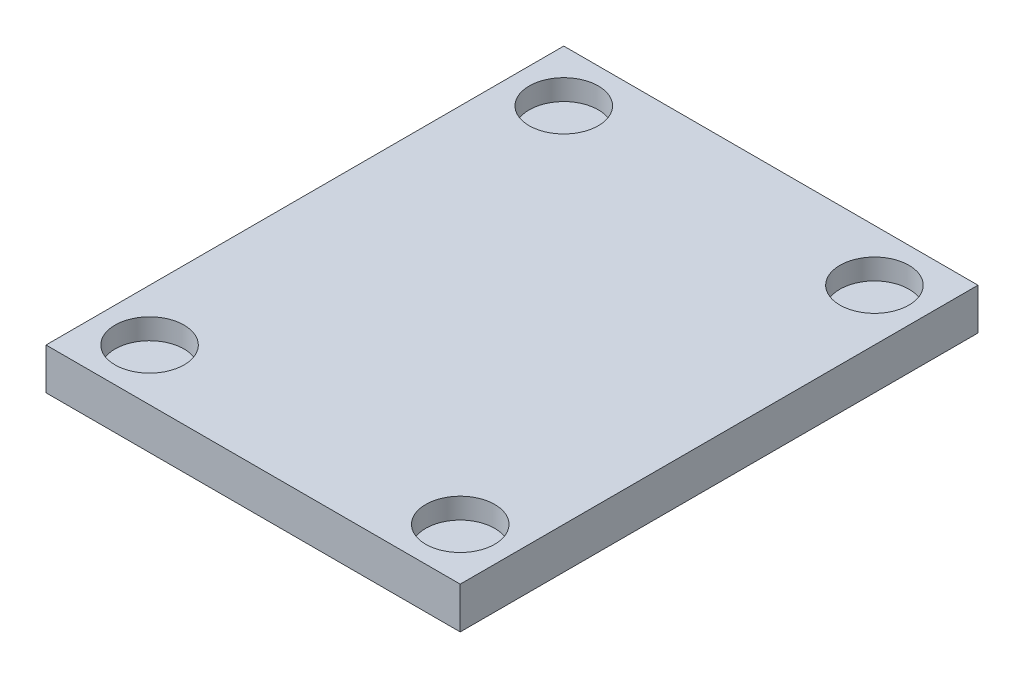
ISO-10303-21;
HEADER;
FILE_DESCRIPTION(('STEP AP214'),'2;1');
FILE_NAME('part.step','',(''),(''),'','','');
FILE_SCHEMA(('AUTOMOTIVE_DESIGN { 1 0 10303 214 1 1 1 1 }'));
ENDSEC;
DATA;
#1=APPLICATION_CONTEXT('core data for automotive mechanical design processes');
#2=APPLICATION_PROTOCOL_DEFINITION('international standard','automotive_design',2000,#1);
#3=PRODUCT_CONTEXT('',#1,'mechanical');
#4=PRODUCT('Part','Part','',(#3));
#5=PRODUCT_RELATED_PRODUCT_CATEGORY('part','',(#4));
#6=PRODUCT_DEFINITION_FORMATION('','',#4);
#7=PRODUCT_DEFINITION_CONTEXT('part definition',#1,'design');
#8=PRODUCT_DEFINITION('design','',#6,#7);
#9=PRODUCT_DEFINITION_SHAPE('','',#8);
#10=(LENGTH_UNIT() NAMED_UNIT(*) SI_UNIT(.MILLI.,.METRE.));
#11=(NAMED_UNIT(*) PLANE_ANGLE_UNIT() SI_UNIT($,.RADIAN.));
#12=(NAMED_UNIT(*) SI_UNIT($,.STERADIAN.) SOLID_ANGLE_UNIT());
#13=UNCERTAINTY_MEASURE_WITH_UNIT(LENGTH_MEASURE(1.E-05),#10,'distance_accuracy_value','');
#14=(GEOMETRIC_REPRESENTATION_CONTEXT(3) GLOBAL_UNCERTAINTY_ASSIGNED_CONTEXT((#13)) GLOBAL_UNIT_ASSIGNED_CONTEXT((#10,
#11,#12)) REPRESENTATION_CONTEXT('',''));
#15=CARTESIAN_POINT('',(0.,0.,0.));
#16=DIRECTION('',(0.,0.,1.));
#17=DIRECTION('',(1.,0.,0.));
#18=AXIS2_PLACEMENT_3D('',#15,#16,#17);
#19=CARTESIAN_POINT('',(30.,3.,75.));
#20=DIRECTION('',(-1.,0.,0.));
#21=DIRECTION('',(0.,0.,1.));
#22=AXIS2_PLACEMENT_3D('',#19,#20,#21);
#23=PLANE('',#22);
#24=DIRECTION('',(0.,1.,0.));
#25=VECTOR('',#24,1.);
#26=CARTESIAN_POINT('',(30.,3.,0.));
#27=LINE('',#26,#25);
#28=CARTESIAN_POINT('',(30.,-3.,0.));
#29=VERTEX_POINT('',#28);
#30=CARTESIAN_POINT('',(30.,3.,0.));
#31=VERTEX_POINT('',#30);
#32=EDGE_CURVE('E96',#29,#31,#27,.T.);
#33=ORIENTED_EDGE('',*,*,#32,.T.);
#34=DIRECTION('',(0.,0.,-1.));
#35=VECTOR('',#34,1.);
#36=CARTESIAN_POINT('',(30.,3.,75.));
#37=LINE('',#36,#35);
#38=CARTESIAN_POINT('',(30.,3.,75.));
#39=VERTEX_POINT('',#38);
#40=EDGE_CURVE('E11',#39,#31,#37,.T.);
#41=ORIENTED_EDGE('',*,*,#40,.F.);
#42=DIRECTION('',(0.,1.,0.));
#43=VECTOR('',#42,1.);
#44=CARTESIAN_POINT('',(30.,3.,75.));
#45=LINE('',#44,#43);
#46=CARTESIAN_POINT('',(30.,-3.,75.));
#47=VERTEX_POINT('',#46);
#48=EDGE_CURVE('E84',#47,#39,#45,.T.);
#49=ORIENTED_EDGE('',*,*,#48,.F.);
#50=DIRECTION('',(0.,0.,-1.));
#51=VECTOR('',#50,1.);
#52=CARTESIAN_POINT('',(30.,-3.,75.));
#53=LINE('',#52,#51);
#54=EDGE_CURVE('E92',#47,#29,#53,.T.);
#55=ORIENTED_EDGE('',*,*,#54,.T.);
#56=EDGE_LOOP('',(#33,#41,#49,#55));
#57=FACE_BOUND('',#56,.T.);
#58=ADVANCED_FACE('F33',(#57),#23,.F.);
#59=CARTESIAN_POINT('',(-30.,3.,75.));
#60=DIRECTION('',(0.,-1.,0.));
#61=DIRECTION('',(0.,0.,-1.));
#62=AXIS2_PLACEMENT_3D('',#59,#60,#61);
#63=PLANE('',#62);
#64=CARTESIAN_POINT('',(-22.5,3.,67.5));
#65=DIRECTION('',(0.,1.,0.));
#66=DIRECTION('',(0.,0.,1.));
#67=AXIS2_PLACEMENT_3D('',#64,#65,#66);
#68=CIRCLE('',#67,5.);
#69=CARTESIAN_POINT('',(-22.5,3.,72.5));
#70=VERTEX_POINT('',#69);
#71=EDGE_CURVE('E128',#70,#70,#68,.T.);
#72=ORIENTED_EDGE('',*,*,#71,.F.);
#73=EDGE_LOOP('',(#72));
#74=FACE_BOUND('',#73,.T.);
#75=CARTESIAN_POINT('',(-22.5,3.,7.5));
#76=DIRECTION('',(0.,1.,0.));
#77=DIRECTION('',(0.,0.,1.));
#78=AXIS2_PLACEMENT_3D('',#75,#76,#77);
#79=CIRCLE('',#78,5.);
#80=CARTESIAN_POINT('',(-22.5,3.,12.5));
#81=VERTEX_POINT('',#80);
#82=EDGE_CURVE('E122',#81,#81,#79,.T.);
#83=ORIENTED_EDGE('',*,*,#82,.F.);
#84=EDGE_LOOP('',(#83));
#85=FACE_BOUND('',#84,.T.);
#86=CARTESIAN_POINT('',(22.5,3.,7.5));
#87=DIRECTION('',(0.,1.,0.));
#88=DIRECTION('',(0.,0.,1.));
#89=AXIS2_PLACEMENT_3D('',#86,#87,#88);
#90=CIRCLE('',#89,5.);
#91=CARTESIAN_POINT('',(22.5,3.,12.5));
#92=VERTEX_POINT('',#91);
#93=EDGE_CURVE('E116',#92,#92,#90,.T.);
#94=ORIENTED_EDGE('',*,*,#93,.F.);
#95=EDGE_LOOP('',(#94));
#96=FACE_BOUND('',#95,.T.);
#97=CARTESIAN_POINT('',(22.5,3.,67.5));
#98=DIRECTION('',(0.,1.,0.));
#99=DIRECTION('',(0.,0.,1.));
#100=AXIS2_PLACEMENT_3D('',#97,#98,#99);
#101=CIRCLE('',#100,5.);
#102=CARTESIAN_POINT('',(22.5,3.,72.5));
#103=VERTEX_POINT('',#102);
#104=EDGE_CURVE('E110',#103,#103,#101,.T.);
#105=ORIENTED_EDGE('',*,*,#104,.F.);
#106=EDGE_LOOP('',(#105));
#107=FACE_BOUND('',#106,.T.);
#108=DIRECTION('',(-1.,0.,0.));
#109=VECTOR('',#108,1.);
#110=CARTESIAN_POINT('',(-30.,3.,0.));
#111=LINE('',#110,#109);
#112=CARTESIAN_POINT('',(-30.,3.,0.));
#113=VERTEX_POINT('',#112);
#114=EDGE_CURVE('E88',#31,#113,#111,.T.);
#115=ORIENTED_EDGE('',*,*,#114,.T.);
#116=DIRECTION('',(0.,0.,-1.));
#117=VECTOR('',#116,1.);
#118=CARTESIAN_POINT('',(-30.,3.,75.));
#119=LINE('',#118,#117);
#120=CARTESIAN_POINT('',(-30.,3.,75.));
#121=VERTEX_POINT('',#120);
#122=EDGE_CURVE('E41',#121,#113,#119,.T.);
#123=ORIENTED_EDGE('',*,*,#122,.F.);
#124=DIRECTION('',(-1.,0.,0.));
#125=VECTOR('',#124,1.);
#126=CARTESIAN_POINT('',(-30.,3.,75.));
#127=LINE('',#126,#125);
#128=EDGE_CURVE('E79',#39,#121,#127,.T.);
#129=ORIENTED_EDGE('',*,*,#128,.F.);
#130=ORIENTED_EDGE('',*,*,#40,.T.);
#131=EDGE_LOOP('',(#115,#123,#129,#130));
#132=FACE_BOUND('',#131,.T.);
#133=ADVANCED_FACE('F87',(#74,#85,#96,#107,#132),#63,.F.);
#134=CARTESIAN_POINT('',(-30.,3.,75.));
#135=DIRECTION('',(1.,0.,0.));
#136=DIRECTION('',(0.,0.,-1.));
#137=AXIS2_PLACEMENT_3D('',#134,#135,#136);
#138=PLANE('',#137);
#139=DIRECTION('',(0.,-1.,0.));
#140=VECTOR('',#139,1.);
#141=CARTESIAN_POINT('',(-30.,3.,0.));
#142=LINE('',#141,#140);
#143=CARTESIAN_POINT('',(-30.,-3.,0.));
#144=VERTEX_POINT('',#143);
#145=EDGE_CURVE('E66',#113,#144,#142,.T.);
#146=ORIENTED_EDGE('',*,*,#145,.T.);
#147=DIRECTION('',(0.,0.,-1.));
#148=VECTOR('',#147,1.);
#149=CARTESIAN_POINT('',(-30.,-3.,75.));
#150=LINE('',#149,#148);
#151=CARTESIAN_POINT('',(-30.,-3.,75.));
#152=VERTEX_POINT('',#151);
#153=EDGE_CURVE('E89',#152,#144,#150,.T.);
#154=ORIENTED_EDGE('',*,*,#153,.F.);
#155=DIRECTION('',(0.,-1.,0.));
#156=VECTOR('',#155,1.);
#157=CARTESIAN_POINT('',(-30.,3.,75.));
#158=LINE('',#157,#156);
#159=EDGE_CURVE('E82',#121,#152,#158,.T.);
#160=ORIENTED_EDGE('',*,*,#159,.F.);
#161=ORIENTED_EDGE('',*,*,#122,.T.);
#162=EDGE_LOOP('',(#146,#154,#160,#161));
#163=FACE_BOUND('',#162,.T.);
#164=ADVANCED_FACE('F90',(#163),#138,.F.);
#165=CARTESIAN_POINT('',(-30.,-3.,75.));
#166=DIRECTION('',(0.,1.,0.));
#167=DIRECTION('',(0.,0.,1.));
#168=AXIS2_PLACEMENT_3D('',#165,#166,#167);
#169=PLANE('',#168);
#170=DIRECTION('',(1.,0.,0.));
#171=VECTOR('',#170,1.);
#172=CARTESIAN_POINT('',(-30.,-3.,0.));
#173=LINE('',#172,#171);
#174=EDGE_CURVE('E72',#144,#29,#173,.T.);
#175=ORIENTED_EDGE('',*,*,#174,.T.);
#176=ORIENTED_EDGE('',*,*,#54,.F.);
#177=DIRECTION('',(1.,0.,0.));
#178=VECTOR('',#177,1.);
#179=CARTESIAN_POINT('',(-30.,-3.,75.));
#180=LINE('',#179,#178);
#181=EDGE_CURVE('E49',#152,#47,#180,.T.);
#182=ORIENTED_EDGE('',*,*,#181,.F.);
#183=ORIENTED_EDGE('',*,*,#153,.T.);
#184=EDGE_LOOP('',(#175,#176,#182,#183));
#185=FACE_BOUND('',#184,.T.);
#186=ADVANCED_FACE('F104',(#185),#169,.F.);
#187=CARTESIAN_POINT('',(0.,0.,75.));
#188=DIRECTION('',(0.,0.,1.));
#189=DIRECTION('',(1.,0.,0.));
#190=AXIS2_PLACEMENT_3D('',#187,#188,#189);
#191=PLANE('',#190);
#192=ORIENTED_EDGE('',*,*,#48,.T.);
#193=ORIENTED_EDGE('',*,*,#128,.T.);
#194=ORIENTED_EDGE('',*,*,#159,.T.);
#195=ORIENTED_EDGE('',*,*,#181,.T.);
#196=EDGE_LOOP('',(#192,#193,#194,#195));
#197=FACE_BOUND('',#196,.T.);
#198=ADVANCED_FACE('F80',(#197),#191,.T.);
#199=CARTESIAN_POINT('',(0.,0.,0.));
#200=DIRECTION('',(0.,0.,1.));
#201=DIRECTION('',(1.,0.,0.));
#202=AXIS2_PLACEMENT_3D('',#199,#200,#201);
#203=PLANE('',#202);
#204=ORIENTED_EDGE('',*,*,#32,.F.);
#205=ORIENTED_EDGE('',*,*,#174,.F.);
#206=ORIENTED_EDGE('',*,*,#145,.F.);
#207=ORIENTED_EDGE('',*,*,#114,.F.);
#208=EDGE_LOOP('',(#204,#205,#206,#207));
#209=FACE_BOUND('',#208,.T.);
#210=ADVANCED_FACE('F107',(#209),#203,.F.);
#211=CARTESIAN_POINT('',(22.5,0.,67.5));
#212=DIRECTION('',(0.,1.,0.));
#213=DIRECTION('',(0.,0.,1.));
#214=AXIS2_PLACEMENT_3D('',#211,#212,#213);
#215=CYLINDRICAL_SURFACE('',#214,5.);
#216=CARTESIAN_POINT('',(22.5,0.,67.5));
#217=DIRECTION('',(0.,1.,0.));
#218=DIRECTION('',(0.,0.,1.));
#219=AXIS2_PLACEMENT_3D('',#216,#217,#218);
#220=CIRCLE('',#219,5.);
#221=CARTESIAN_POINT('',(22.5,0.,72.5));
#222=VERTEX_POINT('',#221);
#223=EDGE_CURVE('E99',#222,#222,#220,.T.);
#224=ORIENTED_EDGE('',*,*,#223,.F.);
#225=EDGE_LOOP('',(#224));
#226=FACE_BOUND('',#225,.T.);
#227=ORIENTED_EDGE('',*,*,#104,.T.);
#228=EDGE_LOOP('',(#227));
#229=FACE_BOUND('',#228,.T.);
#230=ADVANCED_FACE('F151',(#226,#229),#215,.F.);
#231=CARTESIAN_POINT('',(22.5,0.,67.5));
#232=DIRECTION('',(0.,1.,0.));
#233=DIRECTION('',(0.,0.,1.));
#234=AXIS2_PLACEMENT_3D('',#231,#232,#233);
#235=PLANE('',#234);
#236=ORIENTED_EDGE('',*,*,#223,.T.);
#237=EDGE_LOOP('',(#236));
#238=FACE_BOUND('',#237,.T.);
#239=ADVANCED_FACE('F153',(#238),#235,.T.);
#240=CARTESIAN_POINT('',(22.5,0.,7.5));
#241=DIRECTION('',(0.,1.,0.));
#242=DIRECTION('',(0.,0.,1.));
#243=AXIS2_PLACEMENT_3D('',#240,#241,#242);
#244=CYLINDRICAL_SURFACE('',#243,5.);
#245=CARTESIAN_POINT('',(22.5,0.,7.5));
#246=DIRECTION('',(0.,1.,0.));
#247=DIRECTION('',(0.,0.,1.));
#248=AXIS2_PLACEMENT_3D('',#245,#246,#247);
#249=CIRCLE('',#248,5.);
#250=CARTESIAN_POINT('',(22.5,0.,12.5));
#251=VERTEX_POINT('',#250);
#252=EDGE_CURVE('E119',#251,#251,#249,.T.);
#253=ORIENTED_EDGE('',*,*,#252,.F.);
#254=EDGE_LOOP('',(#253));
#255=FACE_BOUND('',#254,.T.);
#256=ORIENTED_EDGE('',*,*,#93,.T.);
#257=EDGE_LOOP('',(#256));
#258=FACE_BOUND('',#257,.T.);
#259=ADVANCED_FACE('F160',(#255,#258),#244,.F.);
#260=CARTESIAN_POINT('',(22.5,0.,7.5));
#261=DIRECTION('',(0.,1.,0.));
#262=DIRECTION('',(0.,0.,1.));
#263=AXIS2_PLACEMENT_3D('',#260,#261,#262);
#264=PLANE('',#263);
#265=ORIENTED_EDGE('',*,*,#252,.T.);
#266=EDGE_LOOP('',(#265));
#267=FACE_BOUND('',#266,.T.);
#268=ADVANCED_FACE('F215',(#267),#264,.T.);
#269=CARTESIAN_POINT('',(-22.5,0.,7.5));
#270=DIRECTION('',(0.,1.,0.));
#271=DIRECTION('',(0.,0.,1.));
#272=AXIS2_PLACEMENT_3D('',#269,#270,#271);
#273=CYLINDRICAL_SURFACE('',#272,5.);
#274=CARTESIAN_POINT('',(-22.5,0.,7.5));
#275=DIRECTION('',(0.,1.,0.));
#276=DIRECTION('',(0.,0.,1.));
#277=AXIS2_PLACEMENT_3D('',#274,#275,#276);
#278=CIRCLE('',#277,5.);
#279=CARTESIAN_POINT('',(-22.5,0.,12.5));
#280=VERTEX_POINT('',#279);
#281=EDGE_CURVE('E125',#280,#280,#278,.T.);
#282=ORIENTED_EDGE('',*,*,#281,.F.);
#283=EDGE_LOOP('',(#282));
#284=FACE_BOUND('',#283,.T.);
#285=ORIENTED_EDGE('',*,*,#82,.T.);
#286=EDGE_LOOP('',(#285));
#287=FACE_BOUND('',#286,.T.);
#288=ADVANCED_FACE('F224',(#284,#287),#273,.F.);
#289=CARTESIAN_POINT('',(-22.5,0.,7.5));
#290=DIRECTION('',(0.,1.,0.));
#291=DIRECTION('',(0.,0.,1.));
#292=AXIS2_PLACEMENT_3D('',#289,#290,#291);
#293=PLANE('',#292);
#294=ORIENTED_EDGE('',*,*,#281,.T.);
#295=EDGE_LOOP('',(#294));
#296=FACE_BOUND('',#295,.T.);
#297=ADVANCED_FACE('F139',(#296),#293,.T.);
#298=CARTESIAN_POINT('',(-22.5,0.,67.5));
#299=DIRECTION('',(0.,1.,0.));
#300=DIRECTION('',(0.,0.,1.));
#301=AXIS2_PLACEMENT_3D('',#298,#299,#300);
#302=CYLINDRICAL_SURFACE('',#301,5.);
#303=CARTESIAN_POINT('',(-22.5,0.,67.5));
#304=DIRECTION('',(0.,1.,0.));
#305=DIRECTION('',(0.,0.,1.));
#306=AXIS2_PLACEMENT_3D('',#303,#304,#305);
#307=CIRCLE('',#306,5.);
#308=CARTESIAN_POINT('',(-22.5,0.,72.5));
#309=VERTEX_POINT('',#308);
#310=EDGE_CURVE('E113',#309,#309,#307,.T.);
#311=ORIENTED_EDGE('',*,*,#310,.F.);
#312=EDGE_LOOP('',(#311));
#313=FACE_BOUND('',#312,.T.);
#314=ORIENTED_EDGE('',*,*,#71,.T.);
#315=EDGE_LOOP('',(#314));
#316=FACE_BOUND('',#315,.T.);
#317=ADVANCED_FACE('F136',(#313,#316),#302,.F.);
#318=CARTESIAN_POINT('',(-22.5,0.,67.5));
#319=DIRECTION('',(0.,1.,0.));
#320=DIRECTION('',(0.,0.,1.));
#321=AXIS2_PLACEMENT_3D('',#318,#319,#320);
#322=PLANE('',#321);
#323=ORIENTED_EDGE('',*,*,#310,.T.);
#324=EDGE_LOOP('',(#323));
#325=FACE_BOUND('',#324,.T.);
#326=ADVANCED_FACE('F134',(#325),#322,.T.);
#327=CLOSED_SHELL('',(#58,#133,#164,#186,#198,#210,#230,#239,#259,#268,#288,#297,#317,#326));
#328=MANIFOLD_SOLID_BREP('B2',#327);
#329=ADVANCED_BREP_SHAPE_REPRESENTATION('',(#18,#328),#14);
#330=SHAPE_DEFINITION_REPRESENTATION(#9,#329);
ENDSEC;
END-ISO-10303-21;
